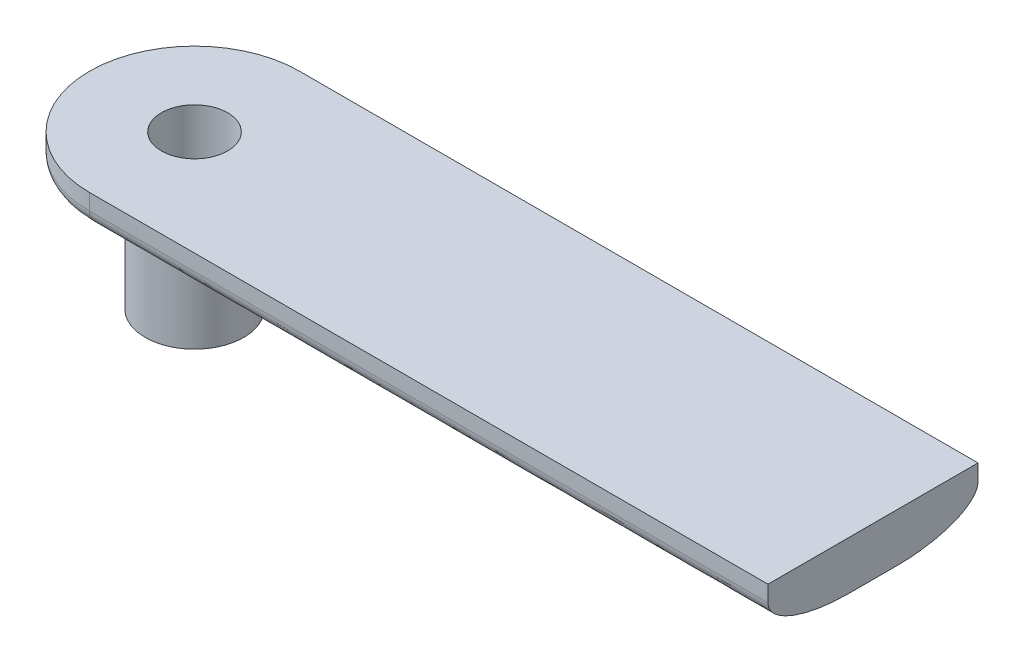
ISO-10303-21;
HEADER;
FILE_DESCRIPTION(('STEP AP214'),'2;1');
FILE_NAME('part.step','',(''),(''),'','','');
FILE_SCHEMA(('AUTOMOTIVE_DESIGN { 1 0 10303 214 1 1 1 1 }'));
ENDSEC;
DATA;
#1=APPLICATION_CONTEXT('core data for automotive mechanical design processes');
#2=APPLICATION_PROTOCOL_DEFINITION('international standard','automotive_design',2000,#1);
#3=PRODUCT_CONTEXT('',#1,'mechanical');
#4=PRODUCT('Part','Part','',(#3));
#5=PRODUCT_RELATED_PRODUCT_CATEGORY('part','',(#4));
#6=PRODUCT_DEFINITION_FORMATION('','',#4);
#7=PRODUCT_DEFINITION_CONTEXT('part definition',#1,'design');
#8=PRODUCT_DEFINITION('design','',#6,#7);
#9=PRODUCT_DEFINITION_SHAPE('','',#8);
#10=(LENGTH_UNIT() NAMED_UNIT(*) SI_UNIT(.MILLI.,.METRE.));
#11=(NAMED_UNIT(*) PLANE_ANGLE_UNIT() SI_UNIT($,.RADIAN.));
#12=(NAMED_UNIT(*) SI_UNIT($,.STERADIAN.) SOLID_ANGLE_UNIT());
#13=UNCERTAINTY_MEASURE_WITH_UNIT(LENGTH_MEASURE(1.E-05),#10,'distance_accuracy_value','');
#14=(GEOMETRIC_REPRESENTATION_CONTEXT(3) GLOBAL_UNCERTAINTY_ASSIGNED_CONTEXT((#13)) GLOBAL_UNIT_ASSIGNED_CONTEXT((#10,
#11,#12)) REPRESENTATION_CONTEXT('',''));
#15=CARTESIAN_POINT('',(0.,0.,0.));
#16=DIRECTION('',(0.,0.,1.));
#17=DIRECTION('',(1.,0.,0.));
#18=AXIS2_PLACEMENT_3D('',#15,#16,#17);
#19=CARTESIAN_POINT('',(0.,3.,0.));
#20=DIRECTION('',(0.,-1.,0.));
#21=DIRECTION('',(0.,0.,-1.));
#22=AXIS2_PLACEMENT_3D('',#19,#20,#21);
#23=CYLINDRICAL_SURFACE('',#22,6.50000000000001);
#24=DIRECTION('',(0.,-1.,0.));
#25=VECTOR('',#24,1.);
#26=CARTESIAN_POINT('',(0.,3.,-6.50000000000001));
#27=LINE('',#26,#25);
#28=CARTESIAN_POINT('',(0.,3.,-6.50000000000001));
#29=VERTEX_POINT('',#28);
#30=CARTESIAN_POINT('',(0.,2.,-6.50000000000001));
#31=VERTEX_POINT('',#30);
#32=EDGE_CURVE('E192',#29,#31,#27,.T.);
#33=ORIENTED_EDGE('',*,*,#32,.T.);
#34=CARTESIAN_POINT('',(0.,2.,6.50000000000001));
#35=CARTESIAN_POINT('',(-0.851001372194236,2.,6.50000000000001));
#36=CARTESIAN_POINT('',(-1.70136130656355,2.,6.33082237422514));
#37=CARTESIAN_POINT('',(-3.27352331418263,2.,5.6796115484216));
#38=CARTESIAN_POINT('',(-3.994553724403,2.,5.19783443102213));
#39=CARTESIAN_POINT('',(-5.19783443102215,2.,3.99455372440297));
#40=CARTESIAN_POINT('',(-5.67961154842164,2.,3.27352331418254));
#41=CARTESIAN_POINT('',(-6.33082237422511,2.,1.70136130656361));
#42=CARTESIAN_POINT('',(-6.50000000000001,2.,0.850847947321459));
#43=CARTESIAN_POINT('',(-6.50000000000001,2.,-0.850847947321462));
#44=CARTESIAN_POINT('',(-6.3308223742251,2.,-1.70136130656364));
#45=CARTESIAN_POINT('',(-5.67961154842162,2.,-3.27352331418256));
#46=CARTESIAN_POINT('',(-5.19783443102222,2.,-3.9945537244029));
#47=CARTESIAN_POINT('',(-3.99455372440289,2.,-5.19783443102223));
#48=CARTESIAN_POINT('',(-3.27352331418265,2.,-5.67961154842159));
#49=CARTESIAN_POINT('',(-1.70136130656348,2.,-6.33082237422516));
#50=CARTESIAN_POINT('',(-0.851001372194256,2.,-6.50000000000001));
#51=CARTESIAN_POINT('',(0.,2.,-6.50000000000001));
#52=(BOUNDED_CURVE() B_SPLINE_CURVE(3,(#34,#35,#36,#37,#38,#39,#40,#41,#42,#43,#44,#45,#46,#47,
#48,#49,#50,#51),.UNSPECIFIED.,.F.,.F.) B_SPLINE_CURVE_WITH_KNOTS((4,2,2,2,2,2,2,2,4),
(3.14159265358979,3.53429173528852,3.92699081698724,4.31968989868597,4.71238898038469,
5.10508806208341,5.49778714378214,5.89048622548086,6.28318530717959),
.UNSPECIFIED.) CURVE() GEOMETRIC_REPRESENTATION_ITEM() RATIONAL_B_SPLINE_CURVE((1.,1.,1.,1.,1.,
1.,1.,1.,1.,1.,1.,1.,1.,1.,1.,1.,1.,1.)) REPRESENTATION_ITEM(''));
#53=CARTESIAN_POINT('',(0.,2.,6.50000000000001));
#54=VERTEX_POINT('',#53);
#55=EDGE_CURVE('E275',#31,#54,#52,.F.);
#56=ORIENTED_EDGE('',*,*,#55,.T.);
#57=DIRECTION('',(0.,-1.,0.));
#58=VECTOR('',#57,1.);
#59=CARTESIAN_POINT('',(0.,3.,6.50000000000001));
#60=LINE('',#59,#58);
#61=CARTESIAN_POINT('',(0.,3.,6.50000000000001));
#62=VERTEX_POINT('',#61);
#63=EDGE_CURVE('E244',#62,#54,#60,.T.);
#64=ORIENTED_EDGE('',*,*,#63,.F.);
#65=CARTESIAN_POINT('',(0.,3.,0.));
#66=DIRECTION('',(0.,1.,0.));
#67=DIRECTION('',(0.,0.,1.));
#68=AXIS2_PLACEMENT_3D('',#65,#66,#67);
#69=CIRCLE('',#68,6.50000000000001);
#70=EDGE_CURVE('E182',#29,#62,#69,.T.);
#71=ORIENTED_EDGE('',*,*,#70,.F.);
#72=EDGE_LOOP('',(#33,#56,#64,#71));
#73=FACE_BOUND('',#72,.T.);
#74=ADVANCED_FACE('F48',(#73),#23,.T.);
#75=CARTESIAN_POINT('',(0.,3.,6.50000000000001));
#76=DIRECTION('',(0.,0.,-1.));
#77=DIRECTION('',(-1.,0.,0.));
#78=AXIS2_PLACEMENT_3D('',#75,#76,#77);
#79=PLANE('',#78);
#80=ORIENTED_EDGE('',*,*,#63,.T.);
#81=CARTESIAN_POINT('',(44.1,2.,6.5));
#82=CARTESIAN_POINT('',(29.4,2.,6.5));
#83=CARTESIAN_POINT('',(14.7,2.,6.5));
#84=CARTESIAN_POINT('',(0.,2.,6.50000000000001));
#85=(BOUNDED_CURVE() B_SPLINE_CURVE(3,(#81,#82,#83,#84),.UNSPECIFIED.,.F.,
.F.) B_SPLINE_CURVE_WITH_KNOTS((4,4),(0.,0.0441),
.UNSPECIFIED.) CURVE() GEOMETRIC_REPRESENTATION_ITEM() RATIONAL_B_SPLINE_CURVE((1.,1.,1.,1.)) REPRESENTATION_ITEM(''));
#86=CARTESIAN_POINT('',(42.,2.,6.5));
#87=VERTEX_POINT('',#86);
#88=EDGE_CURVE('E62',#54,#87,#85,.F.);
#89=ORIENTED_EDGE('',*,*,#88,.T.);
#90=DIRECTION('',(0.,-1.,0.));
#91=VECTOR('',#90,1.);
#92=CARTESIAN_POINT('',(42.,3.,6.5));
#93=LINE('',#92,#91);
#94=CARTESIAN_POINT('',(42.,3.,6.5));
#95=VERTEX_POINT('',#94);
#96=EDGE_CURVE('E254',#95,#87,#93,.T.);
#97=ORIENTED_EDGE('',*,*,#96,.F.);
#98=DIRECTION('',(1.,0.,0.));
#99=VECTOR('',#98,1.);
#100=CARTESIAN_POINT('',(0.,3.,6.50000000000001));
#101=LINE('',#100,#99);
#102=EDGE_CURVE('E185',#62,#95,#101,.T.);
#103=ORIENTED_EDGE('',*,*,#102,.F.);
#104=EDGE_LOOP('',(#80,#89,#97,#103));
#105=FACE_BOUND('',#104,.T.);
#106=ADVANCED_FACE('F230',(#105),#79,.F.);
#107=CARTESIAN_POINT('',(42.,3.,-6.5));
#108=DIRECTION('',(-1.,0.,0.));
#109=DIRECTION('',(0.,0.,1.));
#110=AXIS2_PLACEMENT_3D('',#107,#108,#109);
#111=PLANE('',#110);
#112=DIRECTION('',(0.,0.,-1.));
#113=VECTOR('',#112,1.);
#114=CARTESIAN_POINT('',(42.,0.,-6.5));
#115=LINE('',#114,#113);
#116=CARTESIAN_POINT('',(42.,0.,1.49999999999999));
#117=VERTEX_POINT('',#116);
#118=CARTESIAN_POINT('',(42.,0.,-1.5));
#119=VERTEX_POINT('',#118);
#120=EDGE_CURVE('E186',#117,#119,#115,.T.);
#121=ORIENTED_EDGE('',*,*,#120,.T.);
#122=CARTESIAN_POINT('',(42.,2.,-6.5));
#123=CARTESIAN_POINT('',(42.,0.,-6.5));
#124=CARTESIAN_POINT('',(42.,0.,-1.5));
#125=(BOUNDED_CURVE() B_SPLINE_CURVE(2,(#122,#123,#124),.UNSPECIFIED.,.F.,
.F.) B_SPLINE_CURVE_WITH_KNOTS((3,3),(0.,1.),
.UNSPECIFIED.) CURVE() GEOMETRIC_REPRESENTATION_ITEM() RATIONAL_B_SPLINE_CURVE((1.,
0.707106781186547,1.)) REPRESENTATION_ITEM(''));
#126=CARTESIAN_POINT('',(42.,2.,-6.5));
#127=VERTEX_POINT('',#126);
#128=EDGE_CURVE('E119',#119,#127,#125,.F.);
#129=ORIENTED_EDGE('',*,*,#128,.T.);
#130=DIRECTION('',(0.,-1.,0.));
#131=VECTOR('',#130,1.);
#132=CARTESIAN_POINT('',(42.,3.,-6.5));
#133=LINE('',#132,#131);
#134=CARTESIAN_POINT('',(42.,3.,-6.5));
#135=VERTEX_POINT('',#134);
#136=EDGE_CURVE('E263',#135,#127,#133,.T.);
#137=ORIENTED_EDGE('',*,*,#136,.F.);
#138=DIRECTION('',(0.,0.,-1.));
#139=VECTOR('',#138,1.);
#140=CARTESIAN_POINT('',(42.,3.,-6.5));
#141=LINE('',#140,#139);
#142=EDGE_CURVE('E188',#95,#135,#141,.T.);
#143=ORIENTED_EDGE('',*,*,#142,.F.);
#144=ORIENTED_EDGE('',*,*,#96,.T.);
#145=CARTESIAN_POINT('',(42.,0.,1.5));
#146=CARTESIAN_POINT('',(42.,0.,6.50000000000012));
#147=CARTESIAN_POINT('',(42.,2.,6.5));
#148=(BOUNDED_CURVE() B_SPLINE_CURVE(2,(#145,#146,#147),.UNSPECIFIED.,.F.,
.F.) B_SPLINE_CURVE_WITH_KNOTS((3,3),(0.,1.),
.UNSPECIFIED.) CURVE() GEOMETRIC_REPRESENTATION_ITEM() RATIONAL_B_SPLINE_CURVE((1.,
0.707106781186548,1.)) REPRESENTATION_ITEM(''));
#149=EDGE_CURVE('E125',#87,#117,#148,.F.);
#150=ORIENTED_EDGE('',*,*,#149,.T.);
#151=EDGE_LOOP('',(#121,#129,#137,#143,#144,#150));
#152=FACE_BOUND('',#151,.T.);
#153=ADVANCED_FACE('F225',(#152),#111,.F.);
#154=CARTESIAN_POINT('',(0.,3.,-6.50000000000001));
#155=DIRECTION('',(0.,0.,1.));
#156=DIRECTION('',(1.,0.,0.));
#157=AXIS2_PLACEMENT_3D('',#154,#155,#156);
#158=PLANE('',#157);
#159=ORIENTED_EDGE('',*,*,#136,.T.);
#160=CARTESIAN_POINT('',(0.,2.,-6.50000000000001));
#161=CARTESIAN_POINT('',(14.7,2.,-6.5));
#162=CARTESIAN_POINT('',(29.4000000000001,2.,-6.5));
#163=CARTESIAN_POINT('',(44.1,2.,-6.5));
#164=(BOUNDED_CURVE() B_SPLINE_CURVE(3,(#160,#161,#162,#163),.UNSPECIFIED.,.F.,
.F.) B_SPLINE_CURVE_WITH_KNOTS((4,4),(-0.0441,0.),
.UNSPECIFIED.) CURVE() GEOMETRIC_REPRESENTATION_ITEM() RATIONAL_B_SPLINE_CURVE((1.,1.,1.,1.)) REPRESENTATION_ITEM(''));
#165=EDGE_CURVE('E253',#127,#31,#164,.F.);
#166=ORIENTED_EDGE('',*,*,#165,.T.);
#167=ORIENTED_EDGE('',*,*,#32,.F.);
#168=DIRECTION('',(-1.,0.,0.));
#169=VECTOR('',#168,1.);
#170=CARTESIAN_POINT('',(0.,3.,-6.50000000000001));
#171=LINE('',#170,#169);
#172=EDGE_CURVE('E190',#135,#29,#171,.T.);
#173=ORIENTED_EDGE('',*,*,#172,.F.);
#174=EDGE_LOOP('',(#159,#166,#167,#173));
#175=FACE_BOUND('',#174,.T.);
#176=ADVANCED_FACE('F220',(#175),#158,.F.);
#177=CARTESIAN_POINT('',(0.,3.,0.));
#178=DIRECTION('',(0.,1.,0.));
#179=DIRECTION('',(0.,0.,1.));
#180=AXIS2_PLACEMENT_3D('',#177,#178,#179);
#181=PLANE('',#180);
#182=CARTESIAN_POINT('',(0.,3.,0.));
#183=DIRECTION('',(0.,1.,0.));
#184=DIRECTION('',(0.,0.,1.));
#185=AXIS2_PLACEMENT_3D('',#182,#183,#184);
#186=CIRCLE('',#185,2.05);
#187=CARTESIAN_POINT('',(0.,3.,2.05));
#188=VERTEX_POINT('',#187);
#189=EDGE_CURVE('E464',#188,#188,#186,.T.);
#190=ORIENTED_EDGE('',*,*,#189,.F.);
#191=EDGE_LOOP('',(#190));
#192=FACE_BOUND('',#191,.T.);
#193=ORIENTED_EDGE('',*,*,#70,.T.);
#194=ORIENTED_EDGE('',*,*,#102,.T.);
#195=ORIENTED_EDGE('',*,*,#142,.T.);
#196=ORIENTED_EDGE('',*,*,#172,.T.);
#197=EDGE_LOOP('',(#193,#194,#195,#196));
#198=FACE_BOUND('',#197,.T.);
#199=ADVANCED_FACE('F219',(#192,#198),#181,.T.);
#200=CARTESIAN_POINT('',(0.,0.,0.));
#201=DIRECTION('',(0.,1.,0.));
#202=DIRECTION('',(0.,0.,1.));
#203=AXIS2_PLACEMENT_3D('',#200,#201,#202);
#204=PLANE('',#203);
#205=CARTESIAN_POINT('',(0.,0.,1.50000000000001));
#206=CARTESIAN_POINT('',(14.7,0.,1.50000000000001));
#207=CARTESIAN_POINT('',(29.4000000000001,0.,1.5));
#208=CARTESIAN_POINT('',(44.1,0.,1.5));
#209=(BOUNDED_CURVE() B_SPLINE_CURVE(3,(#205,#206,#207,#208),.UNSPECIFIED.,.F.,
.F.) B_SPLINE_CURVE_WITH_KNOTS((4,4),(0.,0.0441),
.UNSPECIFIED.) CURVE() GEOMETRIC_REPRESENTATION_ITEM() RATIONAL_B_SPLINE_CURVE((1.,1.,1.,1.)) REPRESENTATION_ITEM(''));
#210=CARTESIAN_POINT('',(2.65565434497789,0.,1.50000000000001));
#211=VERTEX_POINT('',#210);
#212=EDGE_CURVE('E126',#117,#211,#209,.F.);
#213=ORIENTED_EDGE('',*,*,#212,.T.);
#214=CARTESIAN_POINT('',(0.,0.,0.));
#215=DIRECTION('',(0.,1.,0.));
#216=DIRECTION('',(0.,0.,1.));
#217=AXIS2_PLACEMENT_3D('',#214,#215,#216);
#218=CIRCLE('',#217,3.05);
#219=CARTESIAN_POINT('',(2.6556543449779,0.,-1.50000000000001));
#220=VERTEX_POINT('',#219);
#221=EDGE_CURVE('E130',#211,#220,#218,.T.);
#222=ORIENTED_EDGE('',*,*,#221,.T.);
#223=CARTESIAN_POINT('',(44.1,0.,-1.5));
#224=CARTESIAN_POINT('',(29.4,0.,-1.5));
#225=CARTESIAN_POINT('',(14.7,0.,-1.50000000000001));
#226=CARTESIAN_POINT('',(0.,0.,-1.50000000000001));
#227=(BOUNDED_CURVE() B_SPLINE_CURVE(3,(#223,#224,#225,#226),.UNSPECIFIED.,.F.,
.F.) B_SPLINE_CURVE_WITH_KNOTS((4,4),(-0.0441,0.),
.UNSPECIFIED.) CURVE() GEOMETRIC_REPRESENTATION_ITEM() RATIONAL_B_SPLINE_CURVE((1.,1.,1.,1.)) REPRESENTATION_ITEM(''));
#228=EDGE_CURVE('E114',#220,#119,#227,.F.);
#229=ORIENTED_EDGE('',*,*,#228,.T.);
#230=ORIENTED_EDGE('',*,*,#120,.F.);
#231=EDGE_LOOP('',(#213,#222,#229,#230));
#232=FACE_BOUND('',#231,.T.);
#233=ADVANCED_FACE('F131',(#232),#204,.F.);
#234=CARTESIAN_POINT('',(0.,2.,6.50000000000001));
#235=CARTESIAN_POINT('',(14.7,2.,6.5));
#236=CARTESIAN_POINT('',(29.4,2.,6.5));
#237=CARTESIAN_POINT('',(44.1,2.,6.5));
#238=CARTESIAN_POINT('',(0.,0.,6.50000000000001));
#239=CARTESIAN_POINT('',(14.7,0.,6.50000000001913));
#240=CARTESIAN_POINT('',(29.4,0.,6.5));
#241=CARTESIAN_POINT('',(44.1,0.,6.5));
#242=CARTESIAN_POINT('',(0.,0.,1.50000000000001));
#243=CARTESIAN_POINT('',(14.7,0.,1.50000000000001));
#244=CARTESIAN_POINT('',(29.4000000000001,0.,1.5));
#245=CARTESIAN_POINT('',(44.1,0.,1.5));
#246=(BOUNDED_SURFACE() B_SPLINE_SURFACE(2,3,((#234,#235,#236,#237),(#238,#239,#240,#241),(#242,
#243,#244,#245)),.UNSPECIFIED.,.F.,.F.,.F.) B_SPLINE_SURFACE_WITH_KNOTS((3,3),(4,4),(0.,1.),(0.,
0.0441),.UNSPECIFIED.) GEOMETRIC_REPRESENTATION_ITEM() RATIONAL_B_SPLINE_SURFACE(((1.,1.,1.,1.),
(0.707106781186548,0.707106781186548,0.707106781186548,0.707106781186548),(1.,1.,1.,1.))) REPRESENTATION_ITEM('') SURFACE());
#247=CARTESIAN_POINT('',(2.6556543449779,0.,1.5));
#248=CARTESIAN_POINT('',(2.61364852955145,-3.09583995054523E-06,1.5743862234863));
#249=CARTESIAN_POINT('',(2.56850625252323,0.000663920053409816,1.64699248246192));
#250=CARTESIAN_POINT('',(2.472310933918,0.00312474774161018,1.78814391899704));
#251=CARTESIAN_POINT('',(2.42125869650968,0.0049184063807589,1.8566896471589));
#252=CARTESIAN_POINT('',(2.31367084674694,0.00941599478927024,1.98914475317652));
#253=CARTESIAN_POINT('',(2.25714316560294,0.0121186215467342,2.05306060947518));
#254=CARTESIAN_POINT('',(2.13897286428343,0.0182035165974505,2.17590662283915));
#255=CARTESIAN_POINT('',(2.07733019324541,0.0215857916494749,2.23483673031533));
#256=CARTESIAN_POINT('',(1.88534260195521,0.0323986323052039,2.40352550915599));
#257=CARTESIAN_POINT('',(1.74784411876693,0.0404998895062592,2.5052981063569));
#258=CARTESIAN_POINT('',(1.45781183600192,0.0565805219868206,2.68447741658484));
#259=CARTESIAN_POINT('',(1.3052696287498,0.0645598261989004,2.76187040177503));
#260=CARTESIAN_POINT('',(0.987965061202078,0.0787245738179821,2.89065782664888));
#261=CARTESIAN_POINT('',(0.823116249641635,0.0848954587321869,2.94184362157759));
#262=CARTESIAN_POINT('',(0.571446298374525,0.0917587235412487,2.99722403013251));
#263=CARTESIAN_POINT('',(0.486870425226594,0.0936472592888916,3.01211550721846));
#264=CARTESIAN_POINT('',(0.316757416969732,0.0965377909941515,3.03471691215815));
#265=CARTESIAN_POINT('',(0.231220730811013,0.0975401848773647,3.04243006355031));
#266=CARTESIAN_POINT('',(0.0970467435446725,0.098376590784796,3.04884354387726));
#267=CARTESIAN_POINT('',(0.0485182741027864,0.0985289678508162,3.05000335148595));
#268=CARTESIAN_POINT('',(0.,0.0985268868585065,3.05));
#269=B_SPLINE_CURVE_WITH_KNOTS('',3,(#247,#248,#249,#250,#251,#252,#253,#254,#255,#256,#257,
#258,#259,#260,#261,#262,#263,#264,#265,#266,#267,#268),.UNSPECIFIED.,.F.,.F.,(4,2,2,2,2,2,2,2,
2,2,4),(0.,0.256191130600483,0.512347442141762,0.768138105989126,1.02393131367619,
1.53507642766351,2.04650884833583,2.56195201089963,2.81939544181132,3.07672320789681,
3.22228936184579),.UNSPECIFIED.);
#270=CARTESIAN_POINT('',(0.,0.098526886857454,3.04999999999193));
#271=VERTEX_POINT('',#270);
#272=EDGE_CURVE('E69',#211,#271,#269,.T.);
#273=CARTESIAN_POINT('',(0.,0.,1.50000000000001));
#274=CARTESIAN_POINT('',(0.,0.,6.50000000000001));
#275=CARTESIAN_POINT('',(0.,2.,6.50000000000001));
#276=(BOUNDED_CURVE() B_SPLINE_CURVE(2,(#273,#274,#275),.UNSPECIFIED.,.F.,
.F.) B_SPLINE_CURVE_WITH_KNOTS((3,3),(0.,1.),
.UNSPECIFIED.) CURVE() GEOMETRIC_REPRESENTATION_ITEM() RATIONAL_B_SPLINE_CURVE((1.,
0.707106781186548,1.)) REPRESENTATION_ITEM(''));
#277=EDGE_CURVE('E199',#271,#54,#276,.T.);
#278=ORIENTED_EDGE('',*,*,#272,.F.);
#279=ORIENTED_EDGE('',*,*,#212,.F.);
#280=ORIENTED_EDGE('',*,*,#149,.F.);
#281=ORIENTED_EDGE('',*,*,#88,.F.);
#282=ORIENTED_EDGE('',*,*,#277,.F.);
#283=EDGE_LOOP('',(#278,#279,#280,#281,#282));
#284=FACE_BOUND('',#283,.T.);
#285=ADVANCED_FACE('F51',(#284),#246,.T.);
#286=CARTESIAN_POINT('',(0.,2.,-6.50000000000001));
#287=CARTESIAN_POINT('',(-0.851001372194256,2.,-6.50000000000001));
#288=CARTESIAN_POINT('',(-1.70136130656348,2.,-6.33082237422516));
#289=CARTESIAN_POINT('',(-3.27352331418265,2.,-5.67961154842159));
#290=CARTESIAN_POINT('',(-3.99455372440289,2.,-5.19783443102223));
#291=CARTESIAN_POINT('',(-5.19783443102222,2.,-3.9945537244029));
#292=CARTESIAN_POINT('',(-5.67961154842162,2.,-3.27352331418256));
#293=CARTESIAN_POINT('',(-6.3308223742251,2.,-1.70136130656364));
#294=CARTESIAN_POINT('',(-6.50000000000001,2.,-0.850847947321462));
#295=CARTESIAN_POINT('',(-6.50000000000001,2.,0.850847947321459));
#296=CARTESIAN_POINT('',(-6.33082237422511,2.,1.70136130656361));
#297=CARTESIAN_POINT('',(-5.67961154842164,2.,3.27352331418254));
#298=CARTESIAN_POINT('',(-5.19783443102215,2.,3.99455372440297));
#299=CARTESIAN_POINT('',(-3.994553724403,2.,5.19783443102213));
#300=CARTESIAN_POINT('',(-3.27352331418263,2.,5.6796115484216));
#301=CARTESIAN_POINT('',(-1.70136130656355,2.,6.33082237422514));
#302=CARTESIAN_POINT('',(-0.851001372194236,2.,6.50000000000001));
#303=CARTESIAN_POINT('',(0.,2.,6.50000000000001));
#304=CARTESIAN_POINT('',(0.,0.,-6.50000000000001));
#305=CARTESIAN_POINT('',(-0.851001372194278,-5.11010252214275E-13,-6.49999999993851));
#306=CARTESIAN_POINT('',(-1.70136130656338,0.,-6.33082237422484));
#307=CARTESIAN_POINT('',(-3.27352331418276,0.,-5.67961154842192));
#308=CARTESIAN_POINT('',(-3.99455372440285,0.,-5.19783443102219));
#309=CARTESIAN_POINT('',(-5.19783443102226,0.,-3.99455372440295));
#310=CARTESIAN_POINT('',(-5.67961154842156,0.,-3.27352331418254));
#311=CARTESIAN_POINT('',(-6.33082237422516,0.,-1.70136130656366));
#312=CARTESIAN_POINT('',(-6.50000000000001,0.,-0.850847947321462));
#313=CARTESIAN_POINT('',(-6.50000000000001,0.,0.850847947321459));
#314=CARTESIAN_POINT('',(-6.33082237422517,0.,1.70136130656364));
#315=CARTESIAN_POINT('',(-5.67961154842158,0.,3.27352331418251));
#316=CARTESIAN_POINT('',(-5.19783443102211,0.,3.99455372440284));
#317=CARTESIAN_POINT('',(-3.99455372440304,0.,5.19783443102226));
#318=CARTESIAN_POINT('',(-3.2735233141827,0.,5.67961154842174));
#319=CARTESIAN_POINT('',(-1.70136130656348,0.,6.33082237422499));
#320=CARTESIAN_POINT('',(-0.851001372194227,-5.11010252213963E-13,6.49999999993851));
#321=CARTESIAN_POINT('',(0.,0.,6.50000000000001));
#322=CARTESIAN_POINT('',(0.,0.,-1.50000000000001));
#323=CARTESIAN_POINT('',(-0.196384932044809,0.,-1.49999999998544));
#324=CARTESIAN_POINT('',(-0.392621839976198,0.,-1.46095900943657));
#325=CARTESIAN_POINT('',(-0.755428457119067,0.,-1.3106795880973));
#326=CARTESIAN_POINT('',(-0.921820090246812,0.,-1.19950025331282));
#327=CARTESIAN_POINT('',(-1.19950025331284,0.,-0.921820090246835));
#328=CARTESIAN_POINT('',(-1.3106795880973,0.,-0.755428457119064));
#329=CARTESIAN_POINT('',(-1.46095900943657,0.,-0.392621839976216));
#330=CARTESIAN_POINT('',(-1.50000000000001,0.,-0.196349526304953));
#331=CARTESIAN_POINT('',(-1.50000000000001,0.,0.196349526304953));
#332=CARTESIAN_POINT('',(-1.46095900943655,0.,0.392621839976211));
#333=CARTESIAN_POINT('',(-1.31067958809732,0.,0.755428457119059));
#334=CARTESIAN_POINT('',(-1.19950025331282,0.,0.921820090246852));
#335=CARTESIAN_POINT('',(-0.921820090246837,0.,1.19950025331279));
#336=CARTESIAN_POINT('',(-0.755428457119072,0.,1.31067958809728));
#337=CARTESIAN_POINT('',(-0.392621839976203,0.,1.46095900943659));
#338=CARTESIAN_POINT('',(-0.196384932044812,0.,1.49999999998544));
#339=CARTESIAN_POINT('',(0.,0.,1.50000000000001));
#340=(BOUNDED_SURFACE() B_SPLINE_SURFACE(2,3,((#286,#287,#288,#289,#290,#291,#292,#293,#294,
#295,#296,#297,#298,#299,#300,#301,#302,#303),(#304,#305,#306,#307,#308,#309,#310,#311,#312,
#313,#314,#315,#316,#317,#318,#319,#320,#321),(#322,#323,#324,#325,#326,#327,#328,#329,#330,
#331,#332,#333,#334,#335,#336,#337,#338,#339)),.UNSPECIFIED.,.F.,.F.,
.F.) B_SPLINE_SURFACE_WITH_KNOTS((3,3),(4,2,2,2,2,2,2,2,4),(0.,1.),(3.14159265358979,
3.53429173528852,3.92699081698724,4.31968989868597,4.71238898038469,5.10508806208341,
5.49778714378214,5.89048622548086,6.28318530717959),
.UNSPECIFIED.) GEOMETRIC_REPRESENTATION_ITEM() RATIONAL_B_SPLINE_SURFACE(((1.,1.,1.,1.,1.,1.,1.,
1.,1.,1.,1.,1.,1.,1.,1.,1.,1.,1.),(0.707106781186548,0.707106781186548,0.707106781186548,
0.707106781186548,0.707106781186548,0.707106781186548,0.707106781186548,0.707106781186548,
0.707106781186548,0.707106781186548,0.707106781186548,0.707106781186548,0.707106781186548,
0.707106781186548,0.707106781186548,0.707106781186548,0.707106781186548,0.707106781186548),(1.,
1.,1.,1.,1.,1.,1.,1.,1.,1.,1.,1.,1.,1.,1.,1.,1.,1.))) REPRESENTATION_ITEM('') SURFACE());
#341=CARTESIAN_POINT('',(0.,0.0985268868585065,3.05));
#342=CARTESIAN_POINT('',(-0.0857839198273671,0.0985281387373563,3.05000821790315));
#343=CARTESIAN_POINT('',(-0.1715639414288,0.0985328184948756,3.04638090737227));
#344=CARTESIAN_POINT('',(-0.34251028210793,0.0985426088078125,3.03191882971791));
#345=CARTESIAN_POINT('',(-0.427676630375766,0.0985477193425907,3.02108440772804));
#346=CARTESIAN_POINT('',(-0.59673860986441,0.0985519461149735,2.99228182255759));
#347=CARTESIAN_POINT('',(-0.680635092213688,0.0985510665635459,2.97431867915751));
#348=CARTESIAN_POINT('',(-0.846596100966768,0.0985428093411967,2.93140438261247));
#349=CARTESIAN_POINT('',(-0.928660649618855,0.098535431749236,2.90645331438367));
#350=CARTESIAN_POINT('',(-1.17131191456233,0.0985264921651077,2.82132066361302));
#351=CARTESIAN_POINT('',(-1.32842783034019,0.0985381061557266,2.75084737488826));
#352=CARTESIAN_POINT('',(-1.62847935578442,0.0985487537224955,2.5845719972564));
#353=CARTESIAN_POINT('',(-1.77141774371712,0.0985477897683804,2.48877488441313));
#354=CARTESIAN_POINT('',(-2.03921117754045,0.0985381175261826,2.27453354814356));
#355=CARTESIAN_POINT('',(-2.1640658255281,0.0985294090677248,2.15608882652683));
#356=CARTESIAN_POINT('',(-2.39213070964965,0.0985367515093074,1.89990342390555));
#357=CARTESIAN_POINT('',(-2.4953376466373,0.0985528061801788,1.7621598070458));
#358=CARTESIAN_POINT('',(-2.67715714947799,0.098547783990139,1.47130545245717));
#359=CARTESIAN_POINT('',(-2.75577080008997,0.0985267087672225,1.3181953929038));
#360=CARTESIAN_POINT('',(-2.88617180050824,0.0985271011362417,1.00096042152227));
#361=CARTESIAN_POINT('',(-2.93796086635441,0.0985485660063507,0.836836215057256));
#362=CARTESIAN_POINT('',(-3.01325164531876,0.0985527736368522,0.502219288239196));
#363=CARTESIAN_POINT('',(-3.03675277767298,0.0985355156022669,0.331726437209112));
#364=CARTESIAN_POINT('',(-3.05479867060366,0.0985287805552927,-0.0107888217499265));
#365=CARTESIAN_POINT('',(-3.04934276515377,0.0985393041818931,-0.182811264769411));
#366=CARTESIAN_POINT('',(-3.00962817889604,0.0985484816335555,-0.523496811896062));
#367=CARTESIAN_POINT('',(-2.97536978449942,0.098547135576648,-0.692159949391004));
#368=CARTESIAN_POINT('',(-2.8790231836004,0.0985378083134316,-1.02134026218298));
#369=CARTESIAN_POINT('',(-2.81693506539326,0.0985298271281739,-1.18185746332279));
#370=CARTESIAN_POINT('',(-2.66668977249729,0.0985373007395196,-1.49019392789399));
#371=CARTESIAN_POINT('',(-2.5785319156271,0.0985527561494452,-1.63801285891203));
#372=CARTESIAN_POINT('',(-2.37865453283688,0.0985474065482851,-1.91674487057169));
#373=CARTESIAN_POINT('',(-2.26693616745988,0.0985266033228598,-2.04765878340842));
#374=CARTESIAN_POINT('',(-2.02312584498549,0.0985273126323415,-2.28885686041603));
#375=CARTESIAN_POINT('',(-1.8910366252748,0.0985488194862794,-2.39914379199175));
#376=CARTESIAN_POINT('',(-1.61016613037745,0.0985528395786997,-2.59601178730574));
#377=CARTESIAN_POINT('',(-1.4613795623071,0.0985353404193417,-2.68258530404888));
#378=CARTESIAN_POINT('',(-1.15132063089767,0.09852805146683,-2.82956470652509));
#379=CARTESIAN_POINT('',(-0.990040734017294,0.098538278521082,-2.88995465635911));
#380=CARTESIAN_POINT('',(-0.659757178736975,0.0985494823966151,-2.98270803377081));
#381=CARTESIAN_POINT('',(-0.490765734767194,0.0985504733687273,-3.0151142667454));
#382=CARTESIAN_POINT('',(-0.26720968913057,0.0985387662390066,-3.03874744241174));
#383=CARTESIAN_POINT('',(-0.213808002459466,0.0985350064379919,-3.0429693810918));
#384=CARTESIAN_POINT('',(-0.106944750298511,0.0985289794822368,-3.04859180705859));
#385=CARTESIAN_POINT('',(-0.0534834297403594,0.0985267098701953,-3.04999694710492));
#386=CARTESIAN_POINT('',(0.,0.0985268868585065,-3.05));
#387=B_SPLINE_CURVE_WITH_KNOTS('',3,(#341,#342,#343,#344,#345,#346,#347,#348,#349,#350,#351,
#352,#353,#354,#355,#356,#357,#358,#359,#360,#361,#362,#363,#364,#365,#366,#367,#368,#369,#370,
#371,#372,#373,#374,#375,#376,#377,#378,#379,#380,#381,#382,#383,#384,#385,#386),.UNSPECIFIED.,
.F.,.F.,(4,2,2,2,2,2,2,2,2,2,2,2,2,2,2,2,2,2,2,2,2,2,4),(0.,0.257268066603139,0.514523814059413,
0.771598732101425,1.02867052634515,1.54259899088421,2.05642654482116,2.57026540297276,
3.08418251419217,3.59807695439517,4.11193851534519,4.62581062592369,5.13969455586914,
5.65357337582635,6.16745056541373,6.68134120310151,7.19520653348476,7.70900287194436,
8.22296254094655,8.73723457958972,9.25071855949232,9.41137176829994,9.57175939237441),.UNSPECIFIED.);
#388=CARTESIAN_POINT('',(0.,0.0985268868579113,-3.04999999999544));
#389=VERTEX_POINT('',#388);
#390=EDGE_CURVE('E77',#271,#389,#387,.T.);
#391=CARTESIAN_POINT('',(0.,0.,-1.50000000000001));
#392=CARTESIAN_POINT('',(0.,0.,-6.50000000000001));
#393=CARTESIAN_POINT('',(0.,2.,-6.50000000000001));
#394=(BOUNDED_CURVE() B_SPLINE_CURVE(2,(#391,#392,#393),.UNSPECIFIED.,.F.,
.F.) B_SPLINE_CURVE_WITH_KNOTS((3,3),(0.,1.),
.UNSPECIFIED.) CURVE() GEOMETRIC_REPRESENTATION_ITEM() RATIONAL_B_SPLINE_CURVE((1.,
0.707106781186548,1.)) REPRESENTATION_ITEM(''));
#395=EDGE_CURVE('E134',#389,#31,#394,.T.);
#396=ORIENTED_EDGE('',*,*,#390,.F.);
#397=ORIENTED_EDGE('',*,*,#277,.T.);
#398=ORIENTED_EDGE('',*,*,#55,.F.);
#399=ORIENTED_EDGE('',*,*,#395,.F.);
#400=EDGE_LOOP('',(#396,#397,#398,#399));
#401=FACE_BOUND('',#400,.T.);
#402=ADVANCED_FACE('F153',(#401),#340,.T.);
#403=CARTESIAN_POINT('',(44.1,2.,-6.5));
#404=CARTESIAN_POINT('',(29.4000000000001,2.,-6.5));
#405=CARTESIAN_POINT('',(14.7,2.,-6.5));
#406=CARTESIAN_POINT('',(0.,2.,-6.50000000000001));
#407=CARTESIAN_POINT('',(44.1,0.,-6.5));
#408=CARTESIAN_POINT('',(29.4,0.,-6.5));
#409=CARTESIAN_POINT('',(14.7,0.,-6.50000000000001));
#410=CARTESIAN_POINT('',(0.,0.,-6.50000000000001));
#411=CARTESIAN_POINT('',(44.1,0.,-1.5));
#412=CARTESIAN_POINT('',(29.4,0.,-1.5));
#413=CARTESIAN_POINT('',(14.7,0.,-1.50000000000001));
#414=CARTESIAN_POINT('',(0.,0.,-1.50000000000001));
#415=(BOUNDED_SURFACE() B_SPLINE_SURFACE(2,3,((#403,#404,#405,#406),(#407,#408,#409,#410),(#411,
#412,#413,#414)),.UNSPECIFIED.,.F.,.F.,.F.) B_SPLINE_SURFACE_WITH_KNOTS((3,3),(4,4),(0.,1.),
(-0.0441,0.),.UNSPECIFIED.) GEOMETRIC_REPRESENTATION_ITEM() RATIONAL_B_SPLINE_SURFACE(((1.,1.,
1.,1.),(0.707106781186548,0.707106781186548,0.707106781186548,0.707106781186548),(1.,1.,1.,1.))) REPRESENTATION_ITEM('') SURFACE());
#416=CARTESIAN_POINT('',(0.,0.0985268868585065,-3.05));
#417=CARTESIAN_POINT('',(0.0854067488639457,0.0985354629558663,-3.050008567781));
#418=CARTESIAN_POINT('',(0.170808800186011,0.0980591955722574,-3.0464126829157));
#419=CARTESIAN_POINT('',(0.340993864595658,0.0962000766634407,-3.03207874463432));
#420=CARTESIAN_POINT('',(0.425776933962725,0.0948173086243654,-3.02134134892976));
#421=CARTESIAN_POINT('',(0.594003332455502,0.0912109923298349,-2.99281264186255));
#422=CARTESIAN_POINT('',(0.677448490025019,0.0889887158307589,-2.97503199822129));
#423=CARTESIAN_POINT('',(0.842515255066484,0.0838269238113444,-2.9325656703348));
#424=CARTESIAN_POINT('',(0.924136869283098,0.0808874109442986,-2.90788001163342));
#425=CARTESIAN_POINT('',(1.16544027473471,0.0712157438691953,-2.82368602341506));
#426=CARTESIAN_POINT('',(1.32168249258852,0.0636274783124226,-2.75401989038115));
#427=CARTESIAN_POINT('',(1.62032218386014,0.0477779412027449,-2.58963134960484));
#428=CARTESIAN_POINT('',(1.76271099683077,0.039516254516214,-2.49489340414427));
#429=CARTESIAN_POINT('',(2.03082625634875,0.0241399846574602,-2.2820382235623));
#430=CARTESIAN_POINT('',(2.15641714370327,0.0170346440411186,-2.16374796156647));
#431=CARTESIAN_POINT('',(2.32835846848047,0.00876325858102682,-1.97196392430815));
#432=CARTESIAN_POINT('',(2.38290503435232,0.00640456579047004,-1.90568626506686));
#433=CARTESIAN_POINT('',(2.48622736893061,0.00270333755132706,-1.76875922460639));
#434=CARTESIAN_POINT('',(2.53500579006804,0.0013603335021535,-1.69811187569262));
#435=CARTESIAN_POINT('',(2.60669916567107,0.000215775740530834,-1.58429967723367));
#436=CARTESIAN_POINT('',(2.63169009104326,-9.02776188076202E-07,-1.54243414236767));
#437=CARTESIAN_POINT('',(2.6556543449779,0.,-1.50000000000001));
#438=B_SPLINE_CURVE_WITH_KNOTS('',3,(#416,#417,#418,#419,#420,#421,#422,#423,#424,#425,#426,
#427,#428,#429,#430,#431,#432,#433,#434,#435,#436,#437),.UNSPECIFIED.,.F.,.F.,(4,2,2,2,2,2,2,2,
2,2,4),(0.,0.256134947610113,0.512246309233234,0.767971238107123,1.02369522098492,
1.53477684230292,2.04617594023242,2.56148070297473,2.81884031242578,3.07608111327591,
3.22229160166346),.UNSPECIFIED.);
#439=EDGE_CURVE('E13',#389,#220,#438,.T.);
#440=ORIENTED_EDGE('',*,*,#439,.F.);
#441=ORIENTED_EDGE('',*,*,#395,.T.);
#442=ORIENTED_EDGE('',*,*,#165,.F.);
#443=ORIENTED_EDGE('',*,*,#128,.F.);
#444=ORIENTED_EDGE('',*,*,#228,.F.);
#445=EDGE_LOOP('',(#440,#441,#442,#443,#444));
#446=FACE_BOUND('',#445,.T.);
#447=ADVANCED_FACE('F117',(#446),#415,.T.);
#448=CARTESIAN_POINT('',(0.,-21.6267027304759,0.));
#449=DIRECTION('',(0.,1.,0.));
#450=DIRECTION('',(0.,0.,1.));
#451=AXIS2_PLACEMENT_3D('',#448,#449,#450);
#452=CYLINDRICAL_SURFACE('',#451,2.05);
#453=CARTESIAN_POINT('',(0.,-6.5,0.));
#454=DIRECTION('',(0.,1.,0.));
#455=DIRECTION('',(0.,0.,1.));
#456=AXIS2_PLACEMENT_3D('',#453,#454,#455);
#457=CIRCLE('',#456,2.05);
#458=CARTESIAN_POINT('',(0.,-6.5,2.05));
#459=VERTEX_POINT('',#458);
#460=EDGE_CURVE('E141',#459,#459,#457,.F.);
#461=ORIENTED_EDGE('',*,*,#460,.T.);
#462=EDGE_LOOP('',(#461));
#463=FACE_BOUND('',#462,.T.);
#464=ORIENTED_EDGE('',*,*,#189,.T.);
#465=EDGE_LOOP('',(#464));
#466=FACE_BOUND('',#465,.T.);
#467=ADVANCED_FACE('F163',(#463,#466),#452,.F.);
#468=CARTESIAN_POINT('',(0.,-21.6267027304759,0.));
#469=DIRECTION('',(0.,1.,0.));
#470=DIRECTION('',(0.,0.,1.));
#471=AXIS2_PLACEMENT_3D('',#468,#469,#470);
#472=CYLINDRICAL_SURFACE('',#471,3.05);
#473=CARTESIAN_POINT('',(0.,-6.5,0.));
#474=DIRECTION('',(0.,1.,0.));
#475=DIRECTION('',(0.,0.,1.));
#476=AXIS2_PLACEMENT_3D('',#473,#474,#475);
#477=CIRCLE('',#476,3.05);
#478=CARTESIAN_POINT('',(0.,-6.5,3.05));
#479=VERTEX_POINT('',#478);
#480=EDGE_CURVE('E137',#479,#479,#477,.F.);
#481=ORIENTED_EDGE('',*,*,#480,.F.);
#482=EDGE_LOOP('',(#481));
#483=FACE_BOUND('',#482,.T.);
#484=ORIENTED_EDGE('',*,*,#221,.F.);
#485=ORIENTED_EDGE('',*,*,#272,.T.);
#486=ORIENTED_EDGE('',*,*,#390,.T.);
#487=ORIENTED_EDGE('',*,*,#439,.T.);
#488=EDGE_LOOP('',(#484,#485,#486,#487));
#489=FACE_BOUND('',#488,.T.);
#490=ADVANCED_FACE('F136',(#483,#489),#472,.T.);
#491=CARTESIAN_POINT('',(0.,-6.5,0.));
#492=DIRECTION('',(0.,1.,0.));
#493=DIRECTION('',(0.,0.,1.));
#494=AXIS2_PLACEMENT_3D('',#491,#492,#493);
#495=PLANE('',#494);
#496=ORIENTED_EDGE('',*,*,#480,.T.);
#497=EDGE_LOOP('',(#496));
#498=FACE_BOUND('',#497,.T.);
#499=ORIENTED_EDGE('',*,*,#460,.F.);
#500=EDGE_LOOP('',(#499));
#501=FACE_BOUND('',#500,.T.);
#502=ADVANCED_FACE('F162',(#498,#501),#495,.F.);
#503=CLOSED_SHELL('',(#74,#106,#153,#176,#199,#233,#285,#402,#447,#467,#490,#502));
#504=MANIFOLD_SOLID_BREP('B2',#503);
#505=ADVANCED_BREP_SHAPE_REPRESENTATION('',(#18,#504),#14);
#506=SHAPE_DEFINITION_REPRESENTATION(#9,#505);
ENDSEC;
END-ISO-10303-21;
